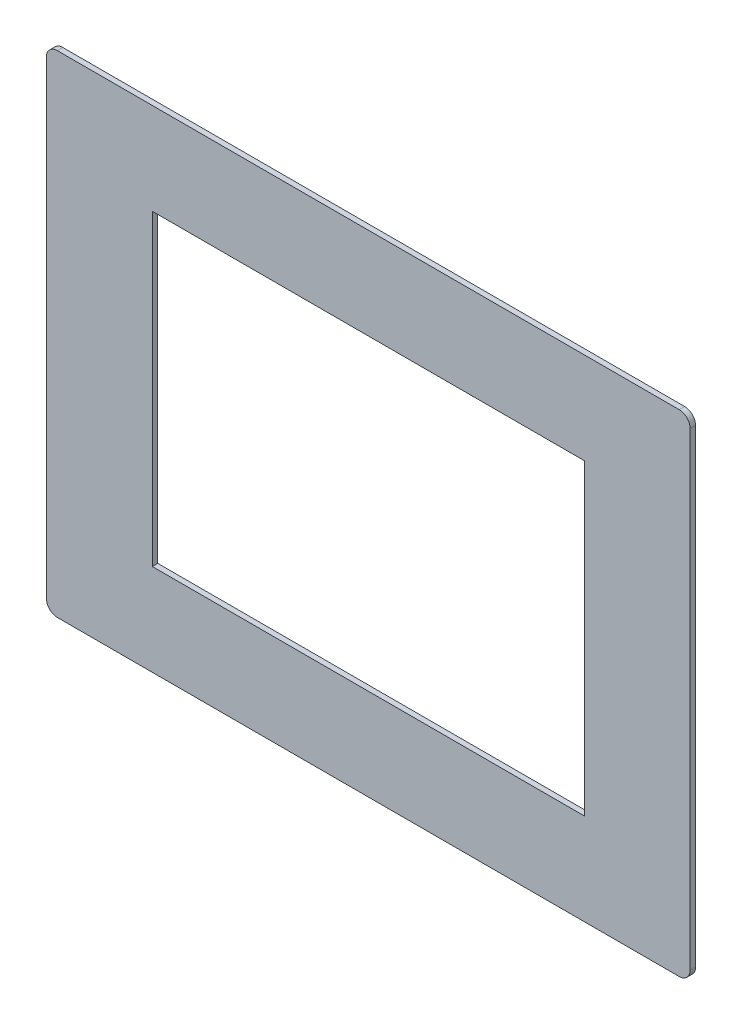
ISO-10303-21;
HEADER;
FILE_DESCRIPTION(('STEP AP214'),'2;1');
FILE_NAME('part.step','',(''),(''),'','','');
FILE_SCHEMA(('AUTOMOTIVE_DESIGN { 1 0 10303 214 1 1 1 1 }'));
ENDSEC;
DATA;
#1=APPLICATION_CONTEXT('core data for automotive mechanical design processes');
#2=APPLICATION_PROTOCOL_DEFINITION('international standard','automotive_design',2000,#1);
#3=PRODUCT_CONTEXT('',#1,'mechanical');
#4=PRODUCT('Part','Part','',(#3));
#5=PRODUCT_RELATED_PRODUCT_CATEGORY('part','',(#4));
#6=PRODUCT_DEFINITION_FORMATION('','',#4);
#7=PRODUCT_DEFINITION_CONTEXT('part definition',#1,'design');
#8=PRODUCT_DEFINITION('design','',#6,#7);
#9=PRODUCT_DEFINITION_SHAPE('','',#8);
#10=(LENGTH_UNIT() NAMED_UNIT(*) SI_UNIT(.MILLI.,.METRE.));
#11=(NAMED_UNIT(*) PLANE_ANGLE_UNIT() SI_UNIT($,.RADIAN.));
#12=(NAMED_UNIT(*) SI_UNIT($,.STERADIAN.) SOLID_ANGLE_UNIT());
#13=UNCERTAINTY_MEASURE_WITH_UNIT(LENGTH_MEASURE(1.E-05),#10,'distance_accuracy_value','');
#14=(GEOMETRIC_REPRESENTATION_CONTEXT(3) GLOBAL_UNCERTAINTY_ASSIGNED_CONTEXT((#13)) GLOBAL_UNIT_ASSIGNED_CONTEXT((#10,
#11,#12)) REPRESENTATION_CONTEXT('',''));
#15=CARTESIAN_POINT('',(0.,0.,0.));
#16=DIRECTION('',(0.,0.,1.));
#17=DIRECTION('',(1.,0.,0.));
#18=AXIS2_PLACEMENT_3D('',#15,#16,#17);
#19=CARTESIAN_POINT('',(0.,0.,2.5));
#20=DIRECTION('',(0.,0.,-1.));
#21=DIRECTION('',(-1.,0.,0.));
#22=AXIS2_PLACEMENT_3D('',#19,#20,#21);
#23=PLANE('',#22);
#24=DIRECTION('',(0.,-1.,0.));
#25=VECTOR('',#24,1.);
#26=CARTESIAN_POINT('',(-147.5,-112.5,2.5));
#27=LINE('',#26,#25);
#28=CARTESIAN_POINT('',(-147.5,107.5,2.5));
#29=VERTEX_POINT('',#28);
#30=CARTESIAN_POINT('',(-147.5,-107.5,2.5));
#31=VERTEX_POINT('',#30);
#32=EDGE_CURVE('E195',#29,#31,#27,.T.);
#33=ORIENTED_EDGE('',*,*,#32,.T.);
#34=CARTESIAN_POINT('',(-142.5,-107.5,2.5));
#35=DIRECTION('',(0.,0.,-1.));
#36=DIRECTION('',(-1.,0.,0.));
#37=AXIS2_PLACEMENT_3D('',#34,#35,#36);
#38=CIRCLE('',#37,5.);
#39=CARTESIAN_POINT('',(-142.5,-112.5,2.5));
#40=VERTEX_POINT('',#39);
#41=EDGE_CURVE('E250',#31,#40,#38,.F.);
#42=ORIENTED_EDGE('',*,*,#41,.T.);
#43=DIRECTION('',(1.,0.,0.));
#44=VECTOR('',#43,1.);
#45=CARTESIAN_POINT('',(-147.5,-112.5,2.5));
#46=LINE('',#45,#44);
#47=CARTESIAN_POINT('',(142.5,-112.5,2.5));
#48=VERTEX_POINT('',#47);
#49=EDGE_CURVE('E199',#40,#48,#46,.T.);
#50=ORIENTED_EDGE('',*,*,#49,.T.);
#51=CARTESIAN_POINT('',(142.5,-107.5,2.5));
#52=DIRECTION('',(0.,0.,-1.));
#53=DIRECTION('',(-1.,0.,0.));
#54=AXIS2_PLACEMENT_3D('',#51,#52,#53);
#55=CIRCLE('',#54,5.);
#56=CARTESIAN_POINT('',(147.5,-107.5,2.5));
#57=VERTEX_POINT('',#56);
#58=EDGE_CURVE('E247',#48,#57,#55,.F.);
#59=ORIENTED_EDGE('',*,*,#58,.T.);
#60=DIRECTION('',(0.,1.,0.));
#61=VECTOR('',#60,1.);
#62=CARTESIAN_POINT('',(147.5,-112.5,2.5));
#63=LINE('',#62,#61);
#64=CARTESIAN_POINT('',(147.5,107.5,2.5));
#65=VERTEX_POINT('',#64);
#66=EDGE_CURVE('E188',#57,#65,#63,.T.);
#67=ORIENTED_EDGE('',*,*,#66,.T.);
#68=CARTESIAN_POINT('',(142.5,107.5,2.5));
#69=DIRECTION('',(0.,0.,-1.));
#70=DIRECTION('',(-1.,0.,0.));
#71=AXIS2_PLACEMENT_3D('',#68,#69,#70);
#72=CIRCLE('',#71,5.);
#73=CARTESIAN_POINT('',(142.5,112.5,2.5));
#74=VERTEX_POINT('',#73);
#75=EDGE_CURVE('E65',#65,#74,#72,.F.);
#76=ORIENTED_EDGE('',*,*,#75,.T.);
#77=DIRECTION('',(-1.,0.,0.));
#78=VECTOR('',#77,1.);
#79=CARTESIAN_POINT('',(-147.5,112.5,2.5));
#80=LINE('',#79,#78);
#81=CARTESIAN_POINT('',(-142.5,112.5,2.5));
#82=VERTEX_POINT('',#81);
#83=EDGE_CURVE('E191',#74,#82,#80,.T.);
#84=ORIENTED_EDGE('',*,*,#83,.T.);
#85=CARTESIAN_POINT('',(-142.5,107.5,2.5));
#86=DIRECTION('',(0.,0.,-1.));
#87=DIRECTION('',(-1.,0.,0.));
#88=AXIS2_PLACEMENT_3D('',#85,#86,#87);
#89=CIRCLE('',#88,5.);
#90=EDGE_CURVE('E242',#82,#29,#89,.F.);
#91=ORIENTED_EDGE('',*,*,#90,.T.);
#92=EDGE_LOOP('',(#33,#42,#50,#59,#67,#76,#84,#91));
#93=FACE_BOUND('',#92,.T.);
#94=DIRECTION('',(0.,1.,0.));
#95=VECTOR('',#94,1.);
#96=CARTESIAN_POINT('',(99.0000000000001,-70.5,2.5));
#97=LINE('',#96,#95);
#98=CARTESIAN_POINT('',(99.0000000000001,-70.5,2.5));
#99=VERTEX_POINT('',#98);
#100=CARTESIAN_POINT('',(99.0000000000001,70.5,2.5));
#101=VERTEX_POINT('',#100);
#102=EDGE_CURVE('E135',#99,#101,#97,.T.);
#103=ORIENTED_EDGE('',*,*,#102,.F.);
#104=DIRECTION('',(1.,0.,0.));
#105=VECTOR('',#104,1.);
#106=CARTESIAN_POINT('',(-98.9999999999999,-70.5,2.5));
#107=LINE('',#106,#105);
#108=CARTESIAN_POINT('',(-98.9999999999999,-70.5,2.5));
#109=VERTEX_POINT('',#108);
#110=EDGE_CURVE('E164',#109,#99,#107,.T.);
#111=ORIENTED_EDGE('',*,*,#110,.F.);
#112=DIRECTION('',(0.,-1.,0.));
#113=VECTOR('',#112,1.);
#114=CARTESIAN_POINT('',(-98.9999999999999,-70.5,2.5));
#115=LINE('',#114,#113);
#116=CARTESIAN_POINT('',(-98.9999999999999,70.5,2.5));
#117=VERTEX_POINT('',#116);
#118=EDGE_CURVE('E160',#117,#109,#115,.T.);
#119=ORIENTED_EDGE('',*,*,#118,.F.);
#120=DIRECTION('',(-1.,0.,0.));
#121=VECTOR('',#120,1.);
#122=CARTESIAN_POINT('',(-98.9999999999999,70.5,2.5));
#123=LINE('',#122,#121);
#124=EDGE_CURVE('E146',#101,#117,#123,.T.);
#125=ORIENTED_EDGE('',*,*,#124,.F.);
#126=EDGE_LOOP('',(#103,#111,#119,#125));
#127=FACE_BOUND('',#126,.T.);
#128=ADVANCED_FACE('F43',(#93,#127),#23,.F.);
#129=CARTESIAN_POINT('',(0.,0.,0.));
#130=DIRECTION('',(0.,0.,-1.));
#131=DIRECTION('',(-1.,0.,0.));
#132=AXIS2_PLACEMENT_3D('',#129,#130,#131);
#133=PLANE('',#132);
#134=DIRECTION('',(1.,0.,0.));
#135=VECTOR('',#134,1.);
#136=CARTESIAN_POINT('',(-147.5,-112.5,0.));
#137=LINE('',#136,#135);
#138=CARTESIAN_POINT('',(-142.5,-112.5,0.));
#139=VERTEX_POINT('',#138);
#140=CARTESIAN_POINT('',(142.5,-112.5,0.));
#141=VERTEX_POINT('',#140);
#142=EDGE_CURVE('E192',#139,#141,#137,.T.);
#143=ORIENTED_EDGE('',*,*,#142,.F.);
#144=CARTESIAN_POINT('',(-142.5,-107.5,0.));
#145=DIRECTION('',(0.,0.,-1.));
#146=DIRECTION('',(-1.,0.,0.));
#147=AXIS2_PLACEMENT_3D('',#144,#145,#146);
#148=CIRCLE('',#147,5.);
#149=CARTESIAN_POINT('',(-147.5,-107.5,0.));
#150=VERTEX_POINT('',#149);
#151=EDGE_CURVE('E232',#139,#150,#148,.T.);
#152=ORIENTED_EDGE('',*,*,#151,.T.);
#153=DIRECTION('',(0.,-1.,0.));
#154=VECTOR('',#153,1.);
#155=CARTESIAN_POINT('',(-147.5,-112.5,0.));
#156=LINE('',#155,#154);
#157=CARTESIAN_POINT('',(-147.5,107.5,0.));
#158=VERTEX_POINT('',#157);
#159=EDGE_CURVE('E210',#158,#150,#156,.T.);
#160=ORIENTED_EDGE('',*,*,#159,.F.);
#161=CARTESIAN_POINT('',(-142.5,107.5,0.));
#162=DIRECTION('',(0.,0.,-1.));
#163=DIRECTION('',(-1.,0.,0.));
#164=AXIS2_PLACEMENT_3D('',#161,#162,#163);
#165=CIRCLE('',#164,5.);
#166=CARTESIAN_POINT('',(-142.5,112.5,0.));
#167=VERTEX_POINT('',#166);
#168=EDGE_CURVE('E223',#158,#167,#165,.T.);
#169=ORIENTED_EDGE('',*,*,#168,.T.);
#170=DIRECTION('',(-1.,0.,0.));
#171=VECTOR('',#170,1.);
#172=CARTESIAN_POINT('',(-147.5,112.5,0.));
#173=LINE('',#172,#171);
#174=CARTESIAN_POINT('',(142.5,112.5,0.));
#175=VERTEX_POINT('',#174);
#176=EDGE_CURVE('E207',#175,#167,#173,.T.);
#177=ORIENTED_EDGE('',*,*,#176,.F.);
#178=CARTESIAN_POINT('',(142.5,107.5,0.));
#179=DIRECTION('',(0.,0.,-1.));
#180=DIRECTION('',(-1.,0.,0.));
#181=AXIS2_PLACEMENT_3D('',#178,#179,#180);
#182=CIRCLE('',#181,5.);
#183=CARTESIAN_POINT('',(147.5,107.5,0.));
#184=VERTEX_POINT('',#183);
#185=EDGE_CURVE('E226',#175,#184,#182,.T.);
#186=ORIENTED_EDGE('',*,*,#185,.T.);
#187=DIRECTION('',(0.,1.,0.));
#188=VECTOR('',#187,1.);
#189=CARTESIAN_POINT('',(147.5,-112.5,0.));
#190=LINE('',#189,#188);
#191=CARTESIAN_POINT('',(147.5,-107.5,0.));
#192=VERTEX_POINT('',#191);
#193=EDGE_CURVE('E155',#192,#184,#190,.T.);
#194=ORIENTED_EDGE('',*,*,#193,.F.);
#195=CARTESIAN_POINT('',(142.5,-107.5,0.));
#196=DIRECTION('',(0.,0.,-1.));
#197=DIRECTION('',(-1.,0.,0.));
#198=AXIS2_PLACEMENT_3D('',#195,#196,#197);
#199=CIRCLE('',#198,5.);
#200=EDGE_CURVE('E229',#192,#141,#199,.T.);
#201=ORIENTED_EDGE('',*,*,#200,.T.);
#202=EDGE_LOOP('',(#143,#152,#160,#169,#177,#186,#194,#201));
#203=FACE_BOUND('',#202,.T.);
#204=DIRECTION('',(1.,0.,0.));
#205=VECTOR('',#204,1.);
#206=CARTESIAN_POINT('',(-98.9999999999999,-70.5,0.));
#207=LINE('',#206,#205);
#208=CARTESIAN_POINT('',(-98.9999999999999,-70.5,0.));
#209=VERTEX_POINT('',#208);
#210=CARTESIAN_POINT('',(99.0000000000001,-70.5,0.));
#211=VERTEX_POINT('',#210);
#212=EDGE_CURVE('E147',#209,#211,#207,.T.);
#213=ORIENTED_EDGE('',*,*,#212,.T.);
#214=DIRECTION('',(0.,1.,0.));
#215=VECTOR('',#214,1.);
#216=CARTESIAN_POINT('',(99.0000000000001,-70.5,0.));
#217=LINE('',#216,#215);
#218=CARTESIAN_POINT('',(99.0000000000001,70.5,0.));
#219=VERTEX_POINT('',#218);
#220=EDGE_CURVE('E169',#211,#219,#217,.T.);
#221=ORIENTED_EDGE('',*,*,#220,.T.);
#222=DIRECTION('',(-1.,0.,0.));
#223=VECTOR('',#222,1.);
#224=CARTESIAN_POINT('',(-98.9999999999999,70.5,0.));
#225=LINE('',#224,#223);
#226=CARTESIAN_POINT('',(-98.9999999999999,70.5,0.));
#227=VERTEX_POINT('',#226);
#228=EDGE_CURVE('E153',#219,#227,#225,.T.);
#229=ORIENTED_EDGE('',*,*,#228,.T.);
#230=DIRECTION('',(0.,-1.,0.));
#231=VECTOR('',#230,1.);
#232=CARTESIAN_POINT('',(-98.9999999999999,-70.5,0.));
#233=LINE('',#232,#231);
#234=EDGE_CURVE('E174',#227,#209,#233,.T.);
#235=ORIENTED_EDGE('',*,*,#234,.T.);
#236=EDGE_LOOP('',(#213,#221,#229,#235));
#237=FACE_BOUND('',#236,.T.);
#238=ADVANCED_FACE('F270',(#203,#237),#133,.T.);
#239=CARTESIAN_POINT('',(147.5,-112.5,2.5));
#240=DIRECTION('',(-1.,0.,0.));
#241=DIRECTION('',(0.,0.,1.));
#242=AXIS2_PLACEMENT_3D('',#239,#240,#241);
#243=PLANE('',#242);
#244=ORIENTED_EDGE('',*,*,#66,.F.);
#245=DIRECTION('',(0.,0.,-1.));
#246=VECTOR('',#245,1.);
#247=CARTESIAN_POINT('',(147.5,-107.5,2.5));
#248=LINE('',#247,#246);
#249=EDGE_CURVE('E256',#57,#192,#248,.T.);
#250=ORIENTED_EDGE('',*,*,#249,.T.);
#251=ORIENTED_EDGE('',*,*,#193,.T.);
#252=DIRECTION('',(0.,0.,-1.));
#253=VECTOR('',#252,1.);
#254=CARTESIAN_POINT('',(147.5,107.5,2.5));
#255=LINE('',#254,#253);
#256=EDGE_CURVE('E253',#184,#65,#255,.F.);
#257=ORIENTED_EDGE('',*,*,#256,.T.);
#258=EDGE_LOOP('',(#244,#250,#251,#257));
#259=FACE_BOUND('',#258,.T.);
#260=ADVANCED_FACE('F264',(#259),#243,.F.);
#261=CARTESIAN_POINT('',(-147.5,112.5,2.5));
#262=DIRECTION('',(0.,-1.,0.));
#263=DIRECTION('',(0.,0.,-1.));
#264=AXIS2_PLACEMENT_3D('',#261,#262,#263);
#265=PLANE('',#264);
#266=ORIENTED_EDGE('',*,*,#83,.F.);
#267=DIRECTION('',(0.,0.,-1.));
#268=VECTOR('',#267,1.);
#269=CARTESIAN_POINT('',(142.5,112.5,2.5));
#270=LINE('',#269,#268);
#271=EDGE_CURVE('E11',#74,#175,#270,.T.);
#272=ORIENTED_EDGE('',*,*,#271,.T.);
#273=ORIENTED_EDGE('',*,*,#176,.T.);
#274=DIRECTION('',(0.,0.,-1.));
#275=VECTOR('',#274,1.);
#276=CARTESIAN_POINT('',(-142.5,112.5,2.5));
#277=LINE('',#276,#275);
#278=EDGE_CURVE('E52',#167,#82,#277,.F.);
#279=ORIENTED_EDGE('',*,*,#278,.T.);
#280=EDGE_LOOP('',(#266,#272,#273,#279));
#281=FACE_BOUND('',#280,.T.);
#282=ADVANCED_FACE('F276',(#281),#265,.F.);
#283=CARTESIAN_POINT('',(-147.5,-112.5,2.5));
#284=DIRECTION('',(1.,0.,0.));
#285=DIRECTION('',(0.,0.,-1.));
#286=AXIS2_PLACEMENT_3D('',#283,#284,#285);
#287=PLANE('',#286);
#288=ORIENTED_EDGE('',*,*,#159,.T.);
#289=DIRECTION('',(0.,0.,-1.));
#290=VECTOR('',#289,1.);
#291=CARTESIAN_POINT('',(-147.5,-107.5,2.5));
#292=LINE('',#291,#290);
#293=EDGE_CURVE('E239',#150,#31,#292,.F.);
#294=ORIENTED_EDGE('',*,*,#293,.T.);
#295=ORIENTED_EDGE('',*,*,#32,.F.);
#296=DIRECTION('',(0.,0.,-1.));
#297=VECTOR('',#296,1.);
#298=CARTESIAN_POINT('',(-147.5,107.5,2.5));
#299=LINE('',#298,#297);
#300=EDGE_CURVE('E235',#29,#158,#299,.T.);
#301=ORIENTED_EDGE('',*,*,#300,.T.);
#302=EDGE_LOOP('',(#288,#294,#295,#301));
#303=FACE_BOUND('',#302,.T.);
#304=ADVANCED_FACE('F283',(#303),#287,.F.);
#305=CARTESIAN_POINT('',(-147.5,-112.5,2.5));
#306=DIRECTION('',(0.,1.,0.));
#307=DIRECTION('',(0.,0.,1.));
#308=AXIS2_PLACEMENT_3D('',#305,#306,#307);
#309=PLANE('',#308);
#310=ORIENTED_EDGE('',*,*,#49,.F.);
#311=DIRECTION('',(0.,0.,-1.));
#312=VECTOR('',#311,1.);
#313=CARTESIAN_POINT('',(-142.5,-112.5,2.5));
#314=LINE('',#313,#312);
#315=EDGE_CURVE('E219',#40,#139,#314,.T.);
#316=ORIENTED_EDGE('',*,*,#315,.T.);
#317=ORIENTED_EDGE('',*,*,#142,.T.);
#318=DIRECTION('',(0.,0.,-1.));
#319=VECTOR('',#318,1.);
#320=CARTESIAN_POINT('',(142.5,-112.5,2.5));
#321=LINE('',#320,#319);
#322=EDGE_CURVE('E203',#141,#48,#321,.F.);
#323=ORIENTED_EDGE('',*,*,#322,.T.);
#324=EDGE_LOOP('',(#310,#316,#317,#323));
#325=FACE_BOUND('',#324,.T.);
#326=ADVANCED_FACE('F291',(#325),#309,.F.);
#327=CARTESIAN_POINT('',(99.0000000000001,-70.5,2.5));
#328=DIRECTION('',(-1.,0.,0.));
#329=DIRECTION('',(0.,0.,1.));
#330=AXIS2_PLACEMENT_3D('',#327,#328,#329);
#331=PLANE('',#330);
#332=ORIENTED_EDGE('',*,*,#220,.F.);
#333=DIRECTION('',(0.,0.,-1.));
#334=VECTOR('',#333,1.);
#335=CARTESIAN_POINT('',(99.0000000000001,-70.5,2.5));
#336=LINE('',#335,#334);
#337=EDGE_CURVE('E141',#99,#211,#336,.T.);
#338=ORIENTED_EDGE('',*,*,#337,.F.);
#339=ORIENTED_EDGE('',*,*,#102,.T.);
#340=DIRECTION('',(0.,0.,-1.));
#341=VECTOR('',#340,1.);
#342=CARTESIAN_POINT('',(99.0000000000001,70.5,2.5));
#343=LINE('',#342,#341);
#344=EDGE_CURVE('E138',#101,#219,#343,.T.);
#345=ORIENTED_EDGE('',*,*,#344,.T.);
#346=EDGE_LOOP('',(#332,#338,#339,#345));
#347=FACE_BOUND('',#346,.T.);
#348=ADVANCED_FACE('F137',(#347),#331,.T.);
#349=CARTESIAN_POINT('',(-98.9999999999999,70.5,2.5));
#350=DIRECTION('',(0.,-1.,0.));
#351=DIRECTION('',(0.,0.,-1.));
#352=AXIS2_PLACEMENT_3D('',#349,#350,#351);
#353=PLANE('',#352);
#354=ORIENTED_EDGE('',*,*,#228,.F.);
#355=ORIENTED_EDGE('',*,*,#344,.F.);
#356=ORIENTED_EDGE('',*,*,#124,.T.);
#357=DIRECTION('',(0.,0.,-1.));
#358=VECTOR('',#357,1.);
#359=CARTESIAN_POINT('',(-98.9999999999999,70.5,2.5));
#360=LINE('',#359,#358);
#361=EDGE_CURVE('E156',#117,#227,#360,.T.);
#362=ORIENTED_EDGE('',*,*,#361,.T.);
#363=EDGE_LOOP('',(#354,#355,#356,#362));
#364=FACE_BOUND('',#363,.T.);
#365=ADVANCED_FACE('F150',(#364),#353,.T.);
#366=CARTESIAN_POINT('',(-98.9999999999999,-70.5,2.5));
#367=DIRECTION('',(1.,0.,0.));
#368=DIRECTION('',(0.,0.,-1.));
#369=AXIS2_PLACEMENT_3D('',#366,#367,#368);
#370=PLANE('',#369);
#371=ORIENTED_EDGE('',*,*,#234,.F.);
#372=ORIENTED_EDGE('',*,*,#361,.F.);
#373=ORIENTED_EDGE('',*,*,#118,.T.);
#374=DIRECTION('',(0.,0.,-1.));
#375=VECTOR('',#374,1.);
#376=CARTESIAN_POINT('',(-98.9999999999999,-70.5,2.5));
#377=LINE('',#376,#375);
#378=EDGE_CURVE('E183',#109,#209,#377,.T.);
#379=ORIENTED_EDGE('',*,*,#378,.T.);
#380=EDGE_LOOP('',(#371,#372,#373,#379));
#381=FACE_BOUND('',#380,.T.);
#382=ADVANCED_FACE('F346',(#381),#370,.T.);
#383=CARTESIAN_POINT('',(-98.9999999999999,-70.5,2.5));
#384=DIRECTION('',(0.,1.,0.));
#385=DIRECTION('',(0.,0.,1.));
#386=AXIS2_PLACEMENT_3D('',#383,#384,#385);
#387=PLANE('',#386);
#388=ORIENTED_EDGE('',*,*,#212,.F.);
#389=ORIENTED_EDGE('',*,*,#378,.F.);
#390=ORIENTED_EDGE('',*,*,#110,.T.);
#391=ORIENTED_EDGE('',*,*,#337,.T.);
#392=EDGE_LOOP('',(#388,#389,#390,#391));
#393=FACE_BOUND('',#392,.T.);
#394=ADVANCED_FACE('F300',(#393),#387,.T.);
#395=CARTESIAN_POINT('',(-142.5,-107.5,2.5));
#396=DIRECTION('',(0.,0.,-1.));
#397=DIRECTION('',(-1.,0.,0.));
#398=AXIS2_PLACEMENT_3D('',#395,#396,#397);
#399=CYLINDRICAL_SURFACE('',#398,5.);
#400=ORIENTED_EDGE('',*,*,#41,.F.);
#401=ORIENTED_EDGE('',*,*,#293,.F.);
#402=ORIENTED_EDGE('',*,*,#151,.F.);
#403=ORIENTED_EDGE('',*,*,#315,.F.);
#404=EDGE_LOOP('',(#400,#401,#402,#403));
#405=FACE_BOUND('',#404,.T.);
#406=ADVANCED_FACE('F288',(#405),#399,.T.);
#407=CARTESIAN_POINT('',(142.5,-107.5,2.5));
#408=DIRECTION('',(0.,0.,-1.));
#409=DIRECTION('',(-1.,0.,0.));
#410=AXIS2_PLACEMENT_3D('',#407,#408,#409);
#411=CYLINDRICAL_SURFACE('',#410,5.);
#412=ORIENTED_EDGE('',*,*,#58,.F.);
#413=ORIENTED_EDGE('',*,*,#322,.F.);
#414=ORIENTED_EDGE('',*,*,#200,.F.);
#415=ORIENTED_EDGE('',*,*,#249,.F.);
#416=EDGE_LOOP('',(#412,#413,#414,#415));
#417=FACE_BOUND('',#416,.T.);
#418=ADVANCED_FACE('F293',(#417),#411,.T.);
#419=CARTESIAN_POINT('',(142.5,107.5,2.5));
#420=DIRECTION('',(0.,0.,-1.));
#421=DIRECTION('',(-1.,0.,0.));
#422=AXIS2_PLACEMENT_3D('',#419,#420,#421);
#423=CYLINDRICAL_SURFACE('',#422,5.);
#424=ORIENTED_EDGE('',*,*,#75,.F.);
#425=ORIENTED_EDGE('',*,*,#256,.F.);
#426=ORIENTED_EDGE('',*,*,#185,.F.);
#427=ORIENTED_EDGE('',*,*,#271,.F.);
#428=EDGE_LOOP('',(#424,#425,#426,#427));
#429=FACE_BOUND('',#428,.T.);
#430=ADVANCED_FACE('F275',(#429),#423,.T.);
#431=CARTESIAN_POINT('',(-142.5,107.5,2.5));
#432=DIRECTION('',(0.,0.,-1.));
#433=DIRECTION('',(-1.,0.,0.));
#434=AXIS2_PLACEMENT_3D('',#431,#432,#433);
#435=CYLINDRICAL_SURFACE('',#434,5.);
#436=ORIENTED_EDGE('',*,*,#90,.F.);
#437=ORIENTED_EDGE('',*,*,#278,.F.);
#438=ORIENTED_EDGE('',*,*,#168,.F.);
#439=ORIENTED_EDGE('',*,*,#300,.F.);
#440=EDGE_LOOP('',(#436,#437,#438,#439));
#441=FACE_BOUND('',#440,.T.);
#442=ADVANCED_FACE('F45',(#441),#435,.T.);
#443=CLOSED_SHELL('',(#128,#238,#260,#282,#304,#326,#348,#365,#382,#394,#406,#418,#430,#442));
#444=MANIFOLD_SOLID_BREP('B2',#443);
#445=ADVANCED_BREP_SHAPE_REPRESENTATION('',(#18,#444),#14);
#446=SHAPE_DEFINITION_REPRESENTATION(#9,#445);
ENDSEC;
END-ISO-10303-21;
